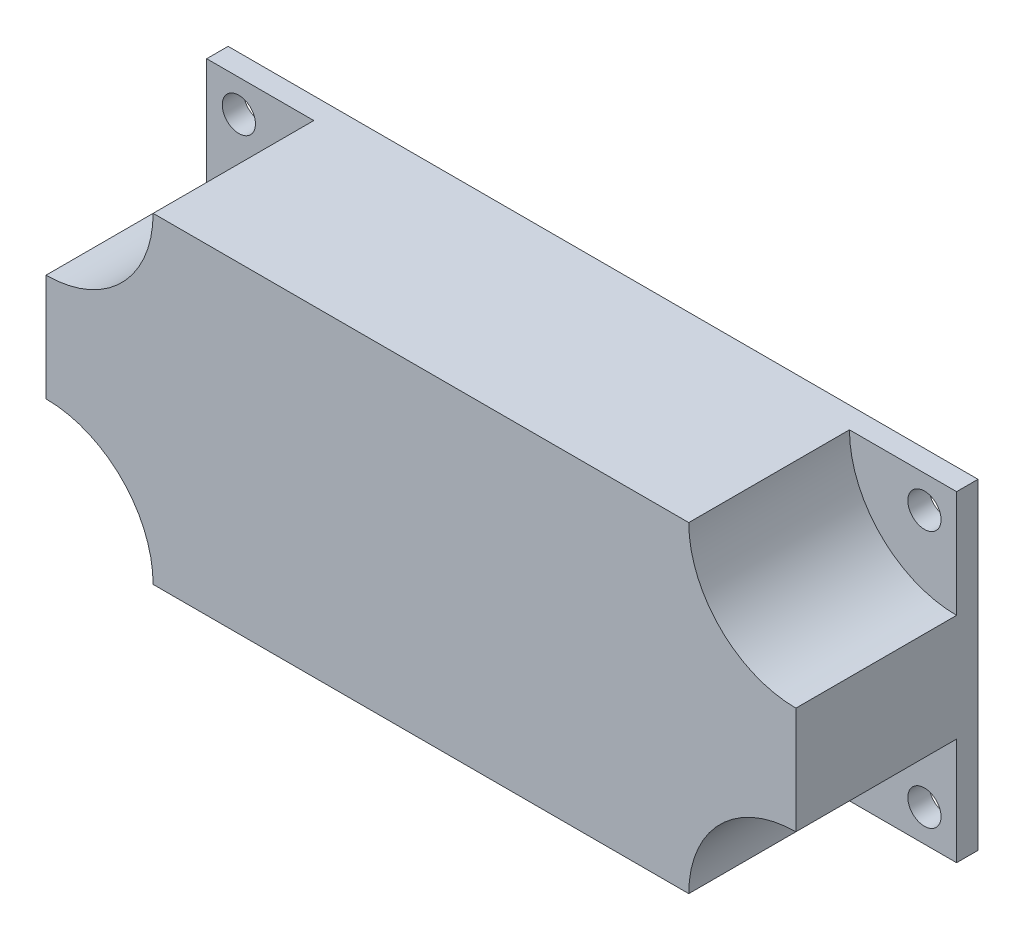
ISO-10303-21;
HEADER;
FILE_DESCRIPTION(('STEP AP214'),'2;1');
FILE_NAME('part.step','',(''),(''),'','','');
FILE_SCHEMA(('AUTOMOTIVE_DESIGN { 1 0 10303 214 1 1 1 1 }'));
ENDSEC;
DATA;
#1=APPLICATION_CONTEXT('core data for automotive mechanical design processes');
#2=APPLICATION_PROTOCOL_DEFINITION('international standard','automotive_design',2000,#1);
#3=PRODUCT_CONTEXT('',#1,'mechanical');
#4=PRODUCT('Part','Part','',(#3));
#5=PRODUCT_RELATED_PRODUCT_CATEGORY('part','',(#4));
#6=PRODUCT_DEFINITION_FORMATION('','',#4);
#7=PRODUCT_DEFINITION_CONTEXT('part definition',#1,'design');
#8=PRODUCT_DEFINITION('design','',#6,#7);
#9=PRODUCT_DEFINITION_SHAPE('','',#8);
#10=(LENGTH_UNIT() NAMED_UNIT(*) SI_UNIT(.MILLI.,.METRE.));
#11=(NAMED_UNIT(*) PLANE_ANGLE_UNIT() SI_UNIT($,.RADIAN.));
#12=(NAMED_UNIT(*) SI_UNIT($,.STERADIAN.) SOLID_ANGLE_UNIT());
#13=UNCERTAINTY_MEASURE_WITH_UNIT(LENGTH_MEASURE(1.E-05),#10,'distance_accuracy_value','');
#14=(GEOMETRIC_REPRESENTATION_CONTEXT(3) GLOBAL_UNCERTAINTY_ASSIGNED_CONTEXT((#13)) GLOBAL_UNIT_ASSIGNED_CONTEXT((#10,
#11,#12)) REPRESENTATION_CONTEXT('',''));
#15=CARTESIAN_POINT('',(0.,0.,0.));
#16=DIRECTION('',(0.,0.,1.));
#17=DIRECTION('',(1.,0.,0.));
#18=AXIS2_PLACEMENT_3D('',#15,#16,#17);
#19=CARTESIAN_POINT('',(0.,0.,17.));
#20=DIRECTION('',(0.,0.,1.));
#21=DIRECTION('',(1.,0.,0.));
#22=AXIS2_PLACEMENT_3D('',#19,#20,#21);
#23=PLANE('',#22);
#24=CARTESIAN_POINT('',(35.,15.,17.));
#25=DIRECTION('',(0.,0.,1.));
#26=DIRECTION('',(1.,0.,0.));
#27=AXIS2_PLACEMENT_3D('',#24,#25,#26);
#28=CIRCLE('',#27,10.);
#29=CARTESIAN_POINT('',(25.,15.,17.));
#30=VERTEX_POINT('',#29);
#31=CARTESIAN_POINT('',(35.,5.,17.));
#32=VERTEX_POINT('',#31);
#33=EDGE_CURVE('E160',#30,#32,#28,.T.);
#34=ORIENTED_EDGE('',*,*,#33,.F.);
#35=DIRECTION('',(-1.,0.,0.));
#36=VECTOR('',#35,1.);
#37=CARTESIAN_POINT('',(-35.,15.,17.));
#38=LINE('',#37,#36);
#39=CARTESIAN_POINT('',(-25.,15.,17.));
#40=VERTEX_POINT('',#39);
#41=EDGE_CURVE('E138',#30,#40,#38,.T.);
#42=ORIENTED_EDGE('',*,*,#41,.T.);
#43=CARTESIAN_POINT('',(-35.,15.,17.));
#44=DIRECTION('',(0.,0.,1.));
#45=DIRECTION('',(1.,0.,0.));
#46=AXIS2_PLACEMENT_3D('',#43,#44,#45);
#47=CIRCLE('',#46,10.);
#48=CARTESIAN_POINT('',(-35.,5.,17.));
#49=VERTEX_POINT('',#48);
#50=EDGE_CURVE('E140',#40,#49,#47,.F.);
#51=ORIENTED_EDGE('',*,*,#50,.T.);
#52=DIRECTION('',(0.,-1.,0.));
#53=VECTOR('',#52,1.);
#54=CARTESIAN_POINT('',(-35.,15.,17.));
#55=LINE('',#54,#53);
#56=CARTESIAN_POINT('',(-35.,-5.,17.));
#57=VERTEX_POINT('',#56);
#58=EDGE_CURVE('E214',#49,#57,#55,.T.);
#59=ORIENTED_EDGE('',*,*,#58,.T.);
#60=CARTESIAN_POINT('',(-35.,-15.,17.));
#61=DIRECTION('',(0.,0.,1.));
#62=DIRECTION('',(1.,0.,0.));
#63=AXIS2_PLACEMENT_3D('',#60,#61,#62);
#64=CIRCLE('',#63,10.);
#65=CARTESIAN_POINT('',(-25.,-15.,17.));
#66=VERTEX_POINT('',#65);
#67=EDGE_CURVE('E166',#57,#66,#64,.F.);
#68=ORIENTED_EDGE('',*,*,#67,.T.);
#69=DIRECTION('',(1.,0.,0.));
#70=VECTOR('',#69,1.);
#71=CARTESIAN_POINT('',(-35.,-15.,17.));
#72=LINE('',#71,#70);
#73=CARTESIAN_POINT('',(25.,-15.,17.));
#74=VERTEX_POINT('',#73);
#75=EDGE_CURVE('E217',#66,#74,#72,.T.);
#76=ORIENTED_EDGE('',*,*,#75,.T.);
#77=CARTESIAN_POINT('',(35.,-15.,17.));
#78=DIRECTION('',(0.,0.,1.));
#79=DIRECTION('',(1.,0.,0.));
#80=AXIS2_PLACEMENT_3D('',#77,#78,#79);
#81=CIRCLE('',#80,10.);
#82=CARTESIAN_POINT('',(35.,-5.,17.));
#83=VERTEX_POINT('',#82);
#84=EDGE_CURVE('E147',#74,#83,#81,.F.);
#85=ORIENTED_EDGE('',*,*,#84,.T.);
#86=DIRECTION('',(0.,1.,0.));
#87=VECTOR('',#86,1.);
#88=CARTESIAN_POINT('',(35.,15.,17.));
#89=LINE('',#88,#87);
#90=EDGE_CURVE('E209',#83,#32,#89,.T.);
#91=ORIENTED_EDGE('',*,*,#90,.T.);
#92=EDGE_LOOP('',(#34,#42,#51,#59,#68,#76,#85,#91));
#93=FACE_BOUND('',#92,.T.);
#94=ADVANCED_FACE('F33',(#93),#23,.T.);
#95=CARTESIAN_POINT('',(-35.,15.,17.));
#96=DIRECTION('',(1.,0.,0.));
#97=DIRECTION('',(0.,1.,0.));
#98=AXIS2_PLACEMENT_3D('',#95,#96,#97);
#99=PLANE('',#98);
#100=DIRECTION('',(0.,0.,1.));
#101=VECTOR('',#100,1.);
#102=CARTESIAN_POINT('',(-35.,-5.,2.));
#103=LINE('',#102,#101);
#104=CARTESIAN_POINT('',(-35.,-5.,2.));
#105=VERTEX_POINT('',#104);
#106=EDGE_CURVE('E174',#105,#57,#103,.T.);
#107=ORIENTED_EDGE('',*,*,#106,.T.);
#108=ORIENTED_EDGE('',*,*,#58,.F.);
#109=DIRECTION('',(0.,0.,1.));
#110=VECTOR('',#109,1.);
#111=CARTESIAN_POINT('',(-35.,5.,2.));
#112=LINE('',#111,#110);
#113=CARTESIAN_POINT('',(-35.,5.,2.));
#114=VERTEX_POINT('',#113);
#115=EDGE_CURVE('E193',#114,#49,#112,.T.);
#116=ORIENTED_EDGE('',*,*,#115,.F.);
#117=DIRECTION('',(0.,-1.,0.));
#118=VECTOR('',#117,1.);
#119=CARTESIAN_POINT('',(-35.,0.,2.));
#120=LINE('',#119,#118);
#121=CARTESIAN_POINT('',(-35.,15.,2.));
#122=VERTEX_POINT('',#121);
#123=EDGE_CURVE('E184',#122,#114,#120,.T.);
#124=ORIENTED_EDGE('',*,*,#123,.F.);
#125=DIRECTION('',(0.,0.,-1.));
#126=VECTOR('',#125,1.);
#127=CARTESIAN_POINT('',(-35.,15.,17.));
#128=LINE('',#127,#126);
#129=CARTESIAN_POINT('',(-35.,15.,0.));
#130=VERTEX_POINT('',#129);
#131=EDGE_CURVE('E41',#122,#130,#128,.T.);
#132=ORIENTED_EDGE('',*,*,#131,.T.);
#133=DIRECTION('',(0.,-1.,0.));
#134=VECTOR('',#133,1.);
#135=CARTESIAN_POINT('',(-35.,15.,0.));
#136=LINE('',#135,#134);
#137=CARTESIAN_POINT('',(-35.,-15.,0.));
#138=VERTEX_POINT('',#137);
#139=EDGE_CURVE('E226',#130,#138,#136,.T.);
#140=ORIENTED_EDGE('',*,*,#139,.T.);
#141=DIRECTION('',(0.,0.,-1.));
#142=VECTOR('',#141,1.);
#143=CARTESIAN_POINT('',(-35.,-15.,17.));
#144=LINE('',#143,#142);
#145=CARTESIAN_POINT('',(-35.,-15.,2.));
#146=VERTEX_POINT('',#145);
#147=EDGE_CURVE('E232',#146,#138,#144,.T.);
#148=ORIENTED_EDGE('',*,*,#147,.F.);
#149=DIRECTION('',(0.,-1.,0.));
#150=VECTOR('',#149,1.);
#151=CARTESIAN_POINT('',(-35.,0.,2.));
#152=LINE('',#151,#150);
#153=EDGE_CURVE('E165',#105,#146,#152,.T.);
#154=ORIENTED_EDGE('',*,*,#153,.F.);
#155=EDGE_LOOP('',(#107,#108,#116,#124,#132,#140,#148,#154));
#156=FACE_BOUND('',#155,.T.);
#157=ADVANCED_FACE('F236',(#156),#99,.F.);
#158=CARTESIAN_POINT('',(35.,15.,17.));
#159=DIRECTION('',(-1.,0.,0.));
#160=DIRECTION('',(0.,-1.,0.));
#161=AXIS2_PLACEMENT_3D('',#158,#159,#160);
#162=PLANE('',#161);
#163=DIRECTION('',(0.,1.,0.));
#164=VECTOR('',#163,1.);
#165=CARTESIAN_POINT('',(35.,0.,2.));
#166=LINE('',#165,#164);
#167=CARTESIAN_POINT('',(35.,5.,2.));
#168=VERTEX_POINT('',#167);
#169=CARTESIAN_POINT('',(35.,15.,2.));
#170=VERTEX_POINT('',#169);
#171=EDGE_CURVE('E126',#168,#170,#166,.T.);
#172=ORIENTED_EDGE('',*,*,#171,.F.);
#173=DIRECTION('',(0.,0.,1.));
#174=VECTOR('',#173,1.);
#175=CARTESIAN_POINT('',(35.,5.,2.));
#176=LINE('',#175,#174);
#177=EDGE_CURVE('E124',#168,#32,#176,.T.);
#178=ORIENTED_EDGE('',*,*,#177,.T.);
#179=ORIENTED_EDGE('',*,*,#90,.F.);
#180=DIRECTION('',(0.,0.,1.));
#181=VECTOR('',#180,1.);
#182=CARTESIAN_POINT('',(35.,-5.,2.));
#183=LINE('',#182,#181);
#184=CARTESIAN_POINT('',(35.,-5.,2.));
#185=VERTEX_POINT('',#184);
#186=EDGE_CURVE('E158',#185,#83,#183,.T.);
#187=ORIENTED_EDGE('',*,*,#186,.F.);
#188=DIRECTION('',(0.,1.,0.));
#189=VECTOR('',#188,1.);
#190=CARTESIAN_POINT('',(35.,0.,2.));
#191=LINE('',#190,#189);
#192=CARTESIAN_POINT('',(35.,-15.,2.));
#193=VERTEX_POINT('',#192);
#194=EDGE_CURVE('E149',#193,#185,#191,.T.);
#195=ORIENTED_EDGE('',*,*,#194,.F.);
#196=DIRECTION('',(0.,0.,-1.));
#197=VECTOR('',#196,1.);
#198=CARTESIAN_POINT('',(35.,-15.,17.));
#199=LINE('',#198,#197);
#200=CARTESIAN_POINT('',(35.,-15.,0.));
#201=VERTEX_POINT('',#200);
#202=EDGE_CURVE('E220',#193,#201,#199,.T.);
#203=ORIENTED_EDGE('',*,*,#202,.T.);
#204=DIRECTION('',(0.,1.,0.));
#205=VECTOR('',#204,1.);
#206=CARTESIAN_POINT('',(35.,15.,0.));
#207=LINE('',#206,#205);
#208=CARTESIAN_POINT('',(35.,15.,0.));
#209=VERTEX_POINT('',#208);
#210=EDGE_CURVE('E208',#201,#209,#207,.T.);
#211=ORIENTED_EDGE('',*,*,#210,.T.);
#212=DIRECTION('',(0.,0.,-1.));
#213=VECTOR('',#212,1.);
#214=CARTESIAN_POINT('',(35.,15.,17.));
#215=LINE('',#214,#213);
#216=EDGE_CURVE('E11',#170,#209,#215,.T.);
#217=ORIENTED_EDGE('',*,*,#216,.F.);
#218=EDGE_LOOP('',(#172,#178,#179,#187,#195,#203,#211,#217));
#219=FACE_BOUND('',#218,.T.);
#220=ADVANCED_FACE('F35',(#219),#162,.F.);
#221=CARTESIAN_POINT('',(-35.,-15.,17.));
#222=DIRECTION('',(0.,1.,0.));
#223=DIRECTION('',(0.,0.,1.));
#224=AXIS2_PLACEMENT_3D('',#221,#222,#223);
#225=PLANE('',#224);
#226=DIRECTION('',(0.,0.,1.));
#227=VECTOR('',#226,1.);
#228=CARTESIAN_POINT('',(25.,-15.,2.));
#229=LINE('',#228,#227);
#230=CARTESIAN_POINT('',(25.,-15.,2.));
#231=VERTEX_POINT('',#230);
#232=EDGE_CURVE('E154',#231,#74,#229,.T.);
#233=ORIENTED_EDGE('',*,*,#232,.T.);
#234=ORIENTED_EDGE('',*,*,#75,.F.);
#235=DIRECTION('',(0.,0.,1.));
#236=VECTOR('',#235,1.);
#237=CARTESIAN_POINT('',(-25.,-15.,2.));
#238=LINE('',#237,#236);
#239=CARTESIAN_POINT('',(-25.,-15.,2.));
#240=VERTEX_POINT('',#239);
#241=EDGE_CURVE('E157',#240,#66,#238,.T.);
#242=ORIENTED_EDGE('',*,*,#241,.F.);
#243=DIRECTION('',(1.,0.,0.));
#244=VECTOR('',#243,1.);
#245=CARTESIAN_POINT('',(0.,-15.,2.));
#246=LINE('',#245,#244);
#247=EDGE_CURVE('E168',#146,#240,#246,.T.);
#248=ORIENTED_EDGE('',*,*,#247,.F.);
#249=ORIENTED_EDGE('',*,*,#147,.T.);
#250=DIRECTION('',(1.,0.,0.));
#251=VECTOR('',#250,1.);
#252=CARTESIAN_POINT('',(-35.,-15.,0.));
#253=LINE('',#252,#251);
#254=EDGE_CURVE('E212',#138,#201,#253,.T.);
#255=ORIENTED_EDGE('',*,*,#254,.T.);
#256=ORIENTED_EDGE('',*,*,#202,.F.);
#257=DIRECTION('',(1.,0.,0.));
#258=VECTOR('',#257,1.);
#259=CARTESIAN_POINT('',(0.,-15.,2.));
#260=LINE('',#259,#258);
#261=EDGE_CURVE('E146',#231,#193,#260,.T.);
#262=ORIENTED_EDGE('',*,*,#261,.F.);
#263=EDGE_LOOP('',(#233,#234,#242,#248,#249,#255,#256,#262));
#264=FACE_BOUND('',#263,.T.);
#265=ADVANCED_FACE('F249',(#264),#225,.F.);
#266=CARTESIAN_POINT('',(32.,-12.,17.));
#267=DIRECTION('',(0.,0.,-1.));
#268=DIRECTION('',(-1.,0.,0.));
#269=AXIS2_PLACEMENT_3D('',#266,#267,#268);
#270=CYLINDRICAL_SURFACE('',#269,1.55);
#271=CARTESIAN_POINT('',(32.,-12.,0.));
#272=DIRECTION('',(0.,0.,1.));
#273=DIRECTION('',(1.,0.,0.));
#274=AXIS2_PLACEMENT_3D('',#271,#272,#273);
#275=CIRCLE('',#274,1.55);
#276=CARTESIAN_POINT('',(33.55,-12.,0.));
#277=VERTEX_POINT('',#276);
#278=EDGE_CURVE('E202',#277,#277,#275,.T.);
#279=ORIENTED_EDGE('',*,*,#278,.F.);
#280=EDGE_LOOP('',(#279));
#281=FACE_BOUND('',#280,.T.);
#282=CARTESIAN_POINT('',(32.,-12.,2.));
#283=DIRECTION('',(0.,0.,1.));
#284=DIRECTION('',(1.,0.,0.));
#285=AXIS2_PLACEMENT_3D('',#282,#283,#284);
#286=CIRCLE('',#285,1.55);
#287=CARTESIAN_POINT('',(33.55,-12.,2.));
#288=VERTEX_POINT('',#287);
#289=EDGE_CURVE('E151',#288,#288,#286,.F.);
#290=ORIENTED_EDGE('',*,*,#289,.F.);
#291=EDGE_LOOP('',(#290));
#292=FACE_BOUND('',#291,.T.);
#293=ADVANCED_FACE('F275',(#281,#292),#270,.F.);
#294=CARTESIAN_POINT('',(32.,12.,17.));
#295=DIRECTION('',(0.,0.,-1.));
#296=DIRECTION('',(-1.,0.,0.));
#297=AXIS2_PLACEMENT_3D('',#294,#295,#296);
#298=CYLINDRICAL_SURFACE('',#297,1.55);
#299=CARTESIAN_POINT('',(32.,12.,0.));
#300=DIRECTION('',(0.,0.,1.));
#301=DIRECTION('',(1.,0.,0.));
#302=AXIS2_PLACEMENT_3D('',#299,#300,#301);
#303=CIRCLE('',#302,1.55);
#304=CARTESIAN_POINT('',(33.55,12.,0.));
#305=VERTEX_POINT('',#304);
#306=EDGE_CURVE('E199',#305,#305,#303,.T.);
#307=ORIENTED_EDGE('',*,*,#306,.F.);
#308=EDGE_LOOP('',(#307));
#309=FACE_BOUND('',#308,.T.);
#310=CARTESIAN_POINT('',(32.,12.,2.));
#311=DIRECTION('',(0.,0.,1.));
#312=DIRECTION('',(1.,0.,0.));
#313=AXIS2_PLACEMENT_3D('',#310,#311,#312);
#314=CIRCLE('',#313,1.55);
#315=CARTESIAN_POINT('',(33.55,12.,2.));
#316=VERTEX_POINT('',#315);
#317=EDGE_CURVE('E133',#316,#316,#314,.F.);
#318=ORIENTED_EDGE('',*,*,#317,.F.);
#319=EDGE_LOOP('',(#318));
#320=FACE_BOUND('',#319,.T.);
#321=ADVANCED_FACE('F277',(#309,#320),#298,.F.);
#322=CARTESIAN_POINT('',(-32.,-12.,17.));
#323=DIRECTION('',(0.,0.,-1.));
#324=DIRECTION('',(-1.,0.,0.));
#325=AXIS2_PLACEMENT_3D('',#322,#323,#324);
#326=CYLINDRICAL_SURFACE('',#325,1.55);
#327=CARTESIAN_POINT('',(-32.,-12.,0.));
#328=DIRECTION('',(0.,0.,1.));
#329=DIRECTION('',(1.,0.,0.));
#330=AXIS2_PLACEMENT_3D('',#327,#328,#329);
#331=CIRCLE('',#330,1.55);
#332=CARTESIAN_POINT('',(-30.45,-12.,0.));
#333=VERTEX_POINT('',#332);
#334=EDGE_CURVE('E195',#333,#333,#331,.T.);
#335=ORIENTED_EDGE('',*,*,#334,.F.);
#336=EDGE_LOOP('',(#335));
#337=FACE_BOUND('',#336,.T.);
#338=CARTESIAN_POINT('',(-32.,-12.,2.));
#339=DIRECTION('',(0.,0.,1.));
#340=DIRECTION('',(1.,0.,0.));
#341=AXIS2_PLACEMENT_3D('',#338,#339,#340);
#342=CIRCLE('',#341,1.55);
#343=CARTESIAN_POINT('',(-30.45,-12.,2.));
#344=VERTEX_POINT('',#343);
#345=EDGE_CURVE('E171',#344,#344,#342,.F.);
#346=ORIENTED_EDGE('',*,*,#345,.F.);
#347=EDGE_LOOP('',(#346));
#348=FACE_BOUND('',#347,.T.);
#349=ADVANCED_FACE('F284',(#337,#348),#326,.F.);
#350=CARTESIAN_POINT('',(-35.,15.,17.));
#351=DIRECTION('',(0.,-1.,0.));
#352=DIRECTION('',(0.,0.,-1.));
#353=AXIS2_PLACEMENT_3D('',#350,#351,#352);
#354=PLANE('',#353);
#355=ORIENTED_EDGE('',*,*,#41,.F.);
#356=DIRECTION('',(0.,0.,1.));
#357=VECTOR('',#356,1.);
#358=CARTESIAN_POINT('',(25.,15.,2.));
#359=LINE('',#358,#357);
#360=CARTESIAN_POINT('',(25.,15.,2.));
#361=VERTEX_POINT('',#360);
#362=EDGE_CURVE('E121',#361,#30,#359,.T.);
#363=ORIENTED_EDGE('',*,*,#362,.F.);
#364=DIRECTION('',(-1.,0.,0.));
#365=VECTOR('',#364,1.);
#366=CARTESIAN_POINT('',(0.,15.,2.));
#367=LINE('',#366,#365);
#368=EDGE_CURVE('E127',#170,#361,#367,.T.);
#369=ORIENTED_EDGE('',*,*,#368,.F.);
#370=ORIENTED_EDGE('',*,*,#216,.T.);
#371=DIRECTION('',(-1.,0.,0.));
#372=VECTOR('',#371,1.);
#373=CARTESIAN_POINT('',(-35.,15.,0.));
#374=LINE('',#373,#372);
#375=EDGE_CURVE('E223',#209,#130,#374,.T.);
#376=ORIENTED_EDGE('',*,*,#375,.T.);
#377=ORIENTED_EDGE('',*,*,#131,.F.);
#378=DIRECTION('',(-1.,0.,0.));
#379=VECTOR('',#378,1.);
#380=CARTESIAN_POINT('',(0.,15.,2.));
#381=LINE('',#380,#379);
#382=CARTESIAN_POINT('',(-25.,15.,2.));
#383=VERTEX_POINT('',#382);
#384=EDGE_CURVE('E182',#383,#122,#381,.T.);
#385=ORIENTED_EDGE('',*,*,#384,.F.);
#386=DIRECTION('',(0.,0.,1.));
#387=VECTOR('',#386,1.);
#388=CARTESIAN_POINT('',(-25.,15.,2.));
#389=LINE('',#388,#387);
#390=EDGE_CURVE('E190',#383,#40,#389,.T.);
#391=ORIENTED_EDGE('',*,*,#390,.T.);
#392=EDGE_LOOP('',(#355,#363,#369,#370,#376,#377,#385,#391));
#393=FACE_BOUND('',#392,.T.);
#394=ADVANCED_FACE('F136',(#393),#354,.F.);
#395=CARTESIAN_POINT('',(-32.,12.,17.));
#396=DIRECTION('',(0.,0.,-1.));
#397=DIRECTION('',(-1.,0.,0.));
#398=AXIS2_PLACEMENT_3D('',#395,#396,#397);
#399=CYLINDRICAL_SURFACE('',#398,1.55);
#400=CARTESIAN_POINT('',(-32.,12.,0.));
#401=DIRECTION('',(0.,0.,1.));
#402=DIRECTION('',(1.,0.,0.));
#403=AXIS2_PLACEMENT_3D('',#400,#401,#402);
#404=CIRCLE('',#403,1.55);
#405=CARTESIAN_POINT('',(-30.45,12.,0.));
#406=VERTEX_POINT('',#405);
#407=EDGE_CURVE('E205',#406,#406,#404,.T.);
#408=ORIENTED_EDGE('',*,*,#407,.F.);
#409=EDGE_LOOP('',(#408));
#410=FACE_BOUND('',#409,.T.);
#411=CARTESIAN_POINT('',(-32.,12.,2.));
#412=DIRECTION('',(0.,0.,1.));
#413=DIRECTION('',(1.,0.,0.));
#414=AXIS2_PLACEMENT_3D('',#411,#412,#413);
#415=CIRCLE('',#414,1.55);
#416=CARTESIAN_POINT('',(-30.45,12.,2.));
#417=VERTEX_POINT('',#416);
#418=EDGE_CURVE('E187',#417,#417,#415,.F.);
#419=ORIENTED_EDGE('',*,*,#418,.F.);
#420=EDGE_LOOP('',(#419));
#421=FACE_BOUND('',#420,.T.);
#422=ADVANCED_FACE('F297',(#410,#421),#399,.F.);
#423=CARTESIAN_POINT('',(0.,0.,0.));
#424=DIRECTION('',(0.,0.,1.));
#425=DIRECTION('',(1.,0.,0.));
#426=AXIS2_PLACEMENT_3D('',#423,#424,#425);
#427=PLANE('',#426);
#428=ORIENTED_EDGE('',*,*,#210,.F.);
#429=ORIENTED_EDGE('',*,*,#254,.F.);
#430=ORIENTED_EDGE('',*,*,#139,.F.);
#431=ORIENTED_EDGE('',*,*,#375,.F.);
#432=EDGE_LOOP('',(#428,#429,#430,#431));
#433=FACE_BOUND('',#432,.T.);
#434=ORIENTED_EDGE('',*,*,#407,.T.);
#435=EDGE_LOOP('',(#434));
#436=FACE_BOUND('',#435,.T.);
#437=ORIENTED_EDGE('',*,*,#278,.T.);
#438=EDGE_LOOP('',(#437));
#439=FACE_BOUND('',#438,.T.);
#440=ORIENTED_EDGE('',*,*,#306,.T.);
#441=EDGE_LOOP('',(#440));
#442=FACE_BOUND('',#441,.T.);
#443=ORIENTED_EDGE('',*,*,#334,.T.);
#444=EDGE_LOOP('',(#443));
#445=FACE_BOUND('',#444,.T.);
#446=ADVANCED_FACE('F245',(#433,#436,#439,#442,#445),#427,.F.);
#447=CARTESIAN_POINT('',(-35.,15.,2.));
#448=DIRECTION('',(0.,0.,1.));
#449=DIRECTION('',(1.,0.,0.));
#450=AXIS2_PLACEMENT_3D('',#447,#448,#449);
#451=CYLINDRICAL_SURFACE('',#450,10.);
#452=ORIENTED_EDGE('',*,*,#50,.F.);
#453=ORIENTED_EDGE('',*,*,#390,.F.);
#454=CARTESIAN_POINT('',(-35.,15.,2.));
#455=DIRECTION('',(0.,0.,1.));
#456=DIRECTION('',(1.,0.,0.));
#457=AXIS2_PLACEMENT_3D('',#454,#455,#456);
#458=CIRCLE('',#457,10.);
#459=EDGE_CURVE('E180',#383,#114,#458,.F.);
#460=ORIENTED_EDGE('',*,*,#459,.T.);
#461=ORIENTED_EDGE('',*,*,#115,.T.);
#462=EDGE_LOOP('',(#452,#453,#460,#461));
#463=FACE_BOUND('',#462,.T.);
#464=ADVANCED_FACE('F299',(#463),#451,.F.);
#465=CARTESIAN_POINT('',(0.,0.,2.));
#466=DIRECTION('',(0.,0.,1.));
#467=DIRECTION('',(1.,0.,0.));
#468=AXIS2_PLACEMENT_3D('',#465,#466,#467);
#469=PLANE('',#468);
#470=ORIENTED_EDGE('',*,*,#459,.F.);
#471=ORIENTED_EDGE('',*,*,#384,.T.);
#472=ORIENTED_EDGE('',*,*,#123,.T.);
#473=EDGE_LOOP('',(#470,#471,#472));
#474=FACE_BOUND('',#473,.T.);
#475=ORIENTED_EDGE('',*,*,#418,.T.);
#476=EDGE_LOOP('',(#475));
#477=FACE_BOUND('',#476,.T.);
#478=ADVANCED_FACE('F315',(#474,#477),#469,.T.);
#479=CARTESIAN_POINT('',(-35.,-15.,2.));
#480=DIRECTION('',(0.,0.,1.));
#481=DIRECTION('',(1.,0.,0.));
#482=AXIS2_PLACEMENT_3D('',#479,#480,#481);
#483=CYLINDRICAL_SURFACE('',#482,10.);
#484=ORIENTED_EDGE('',*,*,#67,.F.);
#485=ORIENTED_EDGE('',*,*,#106,.F.);
#486=CARTESIAN_POINT('',(-35.,-15.,2.));
#487=DIRECTION('',(0.,0.,1.));
#488=DIRECTION('',(1.,0.,0.));
#489=AXIS2_PLACEMENT_3D('',#486,#487,#488);
#490=CIRCLE('',#489,10.);
#491=EDGE_CURVE('E163',#105,#240,#490,.F.);
#492=ORIENTED_EDGE('',*,*,#491,.T.);
#493=ORIENTED_EDGE('',*,*,#241,.T.);
#494=EDGE_LOOP('',(#484,#485,#492,#493));
#495=FACE_BOUND('',#494,.T.);
#496=ADVANCED_FACE('F260',(#495),#483,.F.);
#497=CARTESIAN_POINT('',(0.,0.,2.));
#498=DIRECTION('',(0.,0.,1.));
#499=DIRECTION('',(1.,0.,0.));
#500=AXIS2_PLACEMENT_3D('',#497,#498,#499);
#501=PLANE('',#500);
#502=ORIENTED_EDGE('',*,*,#491,.F.);
#503=ORIENTED_EDGE('',*,*,#153,.T.);
#504=ORIENTED_EDGE('',*,*,#247,.T.);
#505=EDGE_LOOP('',(#502,#503,#504));
#506=FACE_BOUND('',#505,.T.);
#507=ORIENTED_EDGE('',*,*,#345,.T.);
#508=EDGE_LOOP('',(#507));
#509=FACE_BOUND('',#508,.T.);
#510=ADVANCED_FACE('F257',(#506,#509),#501,.T.);
#511=CARTESIAN_POINT('',(35.,15.,2.));
#512=DIRECTION('',(0.,0.,1.));
#513=DIRECTION('',(1.,0.,0.));
#514=AXIS2_PLACEMENT_3D('',#511,#512,#513);
#515=CYLINDRICAL_SURFACE('',#514,10.);
#516=ORIENTED_EDGE('',*,*,#33,.T.);
#517=ORIENTED_EDGE('',*,*,#177,.F.);
#518=CARTESIAN_POINT('',(35.,15.,2.));
#519=DIRECTION('',(0.,0.,1.));
#520=DIRECTION('',(1.,0.,0.));
#521=AXIS2_PLACEMENT_3D('',#518,#519,#520);
#522=CIRCLE('',#521,10.);
#523=EDGE_CURVE('E48',#361,#168,#522,.T.);
#524=ORIENTED_EDGE('',*,*,#523,.F.);
#525=ORIENTED_EDGE('',*,*,#362,.T.);
#526=EDGE_LOOP('',(#516,#517,#524,#525));
#527=FACE_BOUND('',#526,.T.);
#528=ADVANCED_FACE('F119',(#527),#515,.F.);
#529=CARTESIAN_POINT('',(0.,0.,2.));
#530=DIRECTION('',(0.,0.,1.));
#531=DIRECTION('',(1.,0.,0.));
#532=AXIS2_PLACEMENT_3D('',#529,#530,#531);
#533=PLANE('',#532);
#534=ORIENTED_EDGE('',*,*,#317,.T.);
#535=EDGE_LOOP('',(#534));
#536=FACE_BOUND('',#535,.T.);
#537=ORIENTED_EDGE('',*,*,#368,.T.);
#538=ORIENTED_EDGE('',*,*,#523,.T.);
#539=ORIENTED_EDGE('',*,*,#171,.T.);
#540=EDGE_LOOP('',(#537,#538,#539));
#541=FACE_BOUND('',#540,.T.);
#542=ADVANCED_FACE('F130',(#536,#541),#533,.T.);
#543=CARTESIAN_POINT('',(35.,-15.,2.));
#544=DIRECTION('',(0.,0.,1.));
#545=DIRECTION('',(1.,0.,0.));
#546=AXIS2_PLACEMENT_3D('',#543,#544,#545);
#547=CYLINDRICAL_SURFACE('',#546,10.);
#548=ORIENTED_EDGE('',*,*,#84,.F.);
#549=ORIENTED_EDGE('',*,*,#232,.F.);
#550=CARTESIAN_POINT('',(35.,-15.,2.));
#551=DIRECTION('',(0.,0.,1.));
#552=DIRECTION('',(1.,0.,0.));
#553=AXIS2_PLACEMENT_3D('',#550,#551,#552);
#554=CIRCLE('',#553,10.);
#555=EDGE_CURVE('E56',#231,#185,#554,.F.);
#556=ORIENTED_EDGE('',*,*,#555,.T.);
#557=ORIENTED_EDGE('',*,*,#186,.T.);
#558=EDGE_LOOP('',(#548,#549,#556,#557));
#559=FACE_BOUND('',#558,.T.);
#560=ADVANCED_FACE('F264',(#559),#547,.F.);
#561=CARTESIAN_POINT('',(0.,0.,2.));
#562=DIRECTION('',(0.,0.,1.));
#563=DIRECTION('',(1.,0.,0.));
#564=AXIS2_PLACEMENT_3D('',#561,#562,#563);
#565=PLANE('',#564);
#566=ORIENTED_EDGE('',*,*,#555,.F.);
#567=ORIENTED_EDGE('',*,*,#261,.T.);
#568=ORIENTED_EDGE('',*,*,#194,.T.);
#569=EDGE_LOOP('',(#566,#567,#568));
#570=FACE_BOUND('',#569,.T.);
#571=ORIENTED_EDGE('',*,*,#289,.T.);
#572=EDGE_LOOP('',(#571));
#573=FACE_BOUND('',#572,.T.);
#574=ADVANCED_FACE('F269',(#570,#573),#565,.T.);
#575=CLOSED_SHELL('',(#94,#157,#220,#265,#293,#321,#349,#394,#422,#446,#464,#478,#496,#510,#528,
#542,#560,#574));
#576=MANIFOLD_SOLID_BREP('B2',#575);
#577=ADVANCED_BREP_SHAPE_REPRESENTATION('',(#18,#576),#14);
#578=SHAPE_DEFINITION_REPRESENTATION(#9,#577);
ENDSEC;
END-ISO-10303-21;
